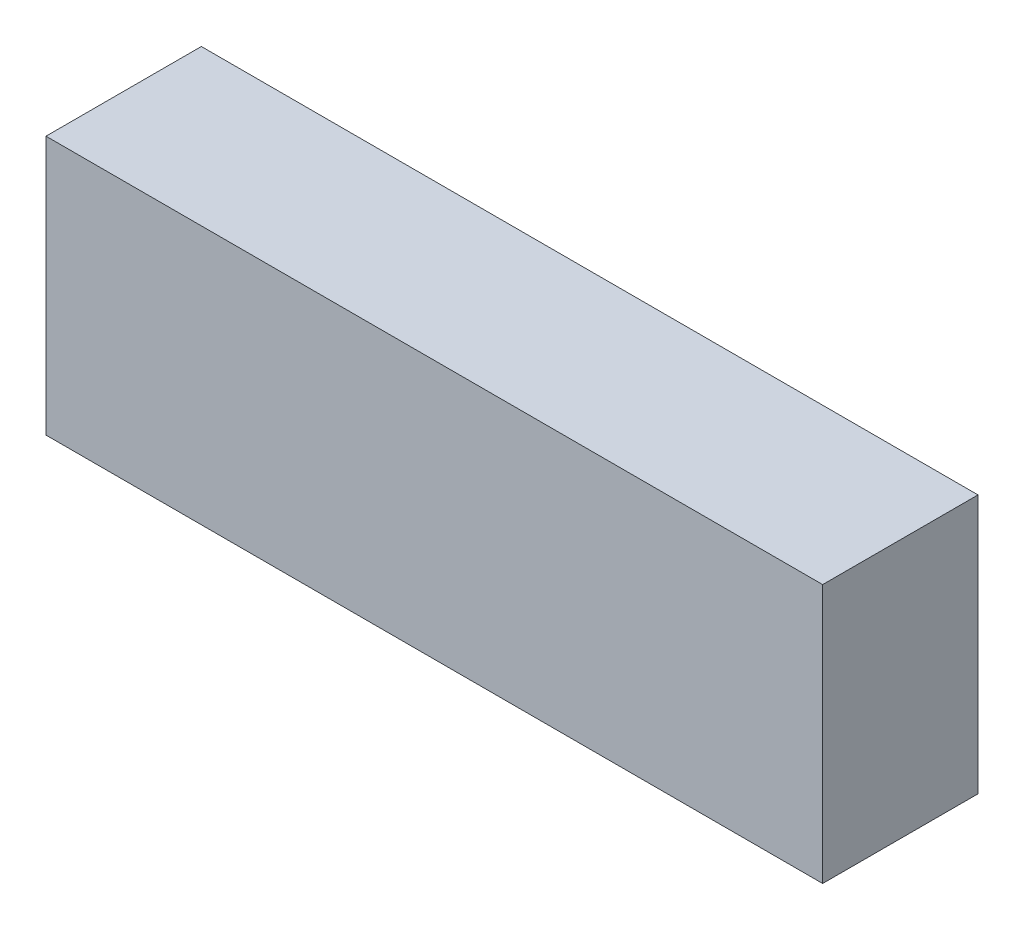
ISO-10303-21;
HEADER;
FILE_DESCRIPTION(('STEP AP214'),'2;1');
FILE_NAME('part.step','',(''),(''),'','','');
FILE_SCHEMA(('AUTOMOTIVE_DESIGN { 1 0 10303 214 1 1 1 1 }'));
ENDSEC;
DATA;
#1=APPLICATION_CONTEXT('core data for automotive mechanical design processes');
#2=APPLICATION_PROTOCOL_DEFINITION('international standard','automotive_design',2000,#1);
#3=PRODUCT_CONTEXT('',#1,'mechanical');
#4=PRODUCT('Part','Part','',(#3));
#5=PRODUCT_RELATED_PRODUCT_CATEGORY('part','',(#4));
#6=PRODUCT_DEFINITION_FORMATION('','',#4);
#7=PRODUCT_DEFINITION_CONTEXT('part definition',#1,'design');
#8=PRODUCT_DEFINITION('design','',#6,#7);
#9=PRODUCT_DEFINITION_SHAPE('','',#8);
#10=(LENGTH_UNIT() NAMED_UNIT(*) SI_UNIT(.MILLI.,.METRE.));
#11=(NAMED_UNIT(*) PLANE_ANGLE_UNIT() SI_UNIT($,.RADIAN.));
#12=(NAMED_UNIT(*) SI_UNIT($,.STERADIAN.) SOLID_ANGLE_UNIT());
#13=UNCERTAINTY_MEASURE_WITH_UNIT(LENGTH_MEASURE(1.E-05),#10,'distance_accuracy_value','');
#14=(GEOMETRIC_REPRESENTATION_CONTEXT(3) GLOBAL_UNCERTAINTY_ASSIGNED_CONTEXT((#13)) GLOBAL_UNIT_ASSIGNED_CONTEXT((#10,
#11,#12)) REPRESENTATION_CONTEXT('',''));
#15=CARTESIAN_POINT('',(0.,0.,0.));
#16=DIRECTION('',(0.,0.,1.));
#17=DIRECTION('',(1.,0.,0.));
#18=AXIS2_PLACEMENT_3D('',#15,#16,#17);
#19=CARTESIAN_POINT('',(-75.,50.,-28.2352941176471));
#20=DIRECTION('',(1.,0.,0.));
#21=DIRECTION('',(0.,0.,-1.));
#22=AXIS2_PLACEMENT_3D('',#19,#20,#21);
#23=PLANE('',#22);
#24=DIRECTION('',(0.,0.,1.));
#25=VECTOR('',#24,1.);
#26=CARTESIAN_POINT('',(-75.,0.,-28.2352941176471));
#27=LINE('',#26,#25);
#28=CARTESIAN_POINT('',(-75.,0.,-28.2352941176471));
#29=VERTEX_POINT('',#28);
#30=CARTESIAN_POINT('',(-75.,0.,1.76470588235295));
#31=VERTEX_POINT('',#30);
#32=EDGE_CURVE('E98',#29,#31,#27,.T.);
#33=ORIENTED_EDGE('',*,*,#32,.T.);
#34=DIRECTION('',(0.,-1.,0.));
#35=VECTOR('',#34,1.);
#36=CARTESIAN_POINT('',(-75.,50.,1.76470588235295));
#37=LINE('',#36,#35);
#38=CARTESIAN_POINT('',(-75.,50.,1.76470588235295));
#39=VERTEX_POINT('',#38);
#40=EDGE_CURVE('E11',#39,#31,#37,.T.);
#41=ORIENTED_EDGE('',*,*,#40,.F.);
#42=DIRECTION('',(0.,0.,1.));
#43=VECTOR('',#42,1.);
#44=CARTESIAN_POINT('',(-75.,50.,-28.2352941176471));
#45=LINE('',#44,#43);
#46=CARTESIAN_POINT('',(-75.,50.,-28.2352941176471));
#47=VERTEX_POINT('',#46);
#48=EDGE_CURVE('E86',#47,#39,#45,.T.);
#49=ORIENTED_EDGE('',*,*,#48,.F.);
#50=DIRECTION('',(0.,-1.,0.));
#51=VECTOR('',#50,1.);
#52=CARTESIAN_POINT('',(-75.,50.,-28.2352941176471));
#53=LINE('',#52,#51);
#54=EDGE_CURVE('E94',#47,#29,#53,.T.);
#55=ORIENTED_EDGE('',*,*,#54,.T.);
#56=EDGE_LOOP('',(#33,#41,#49,#55));
#57=FACE_BOUND('',#56,.T.);
#58=ADVANCED_FACE('F35',(#57),#23,.F.);
#59=CARTESIAN_POINT('',(-75.,50.,1.76470588235295));
#60=DIRECTION('',(0.,0.,-1.));
#61=DIRECTION('',(-1.,0.,0.));
#62=AXIS2_PLACEMENT_3D('',#59,#60,#61);
#63=PLANE('',#62);
#64=DIRECTION('',(1.,0.,0.));
#65=VECTOR('',#64,1.);
#66=CARTESIAN_POINT('',(-75.,0.,1.76470588235295));
#67=LINE('',#66,#65);
#68=CARTESIAN_POINT('',(75.,0.,1.76470588235295));
#69=VERTEX_POINT('',#68);
#70=EDGE_CURVE('E90',#31,#69,#67,.T.);
#71=ORIENTED_EDGE('',*,*,#70,.T.);
#72=DIRECTION('',(0.,-1.,0.));
#73=VECTOR('',#72,1.);
#74=CARTESIAN_POINT('',(75.,50.,1.76470588235295));
#75=LINE('',#74,#73);
#76=CARTESIAN_POINT('',(75.,50.,1.76470588235295));
#77=VERTEX_POINT('',#76);
#78=EDGE_CURVE('E43',#77,#69,#75,.T.);
#79=ORIENTED_EDGE('',*,*,#78,.F.);
#80=DIRECTION('',(1.,0.,0.));
#81=VECTOR('',#80,1.);
#82=CARTESIAN_POINT('',(-75.,50.,1.76470588235295));
#83=LINE('',#82,#81);
#84=EDGE_CURVE('E81',#39,#77,#83,.T.);
#85=ORIENTED_EDGE('',*,*,#84,.F.);
#86=ORIENTED_EDGE('',*,*,#40,.T.);
#87=EDGE_LOOP('',(#71,#79,#85,#86));
#88=FACE_BOUND('',#87,.T.);
#89=ADVANCED_FACE('F89',(#88),#63,.F.);
#90=CARTESIAN_POINT('',(75.,50.,-28.2352941176471));
#91=DIRECTION('',(-1.,0.,0.));
#92=DIRECTION('',(0.,0.,1.));
#93=AXIS2_PLACEMENT_3D('',#90,#91,#92);
#94=PLANE('',#93);
#95=DIRECTION('',(0.,0.,-1.));
#96=VECTOR('',#95,1.);
#97=CARTESIAN_POINT('',(75.,0.,-28.2352941176471));
#98=LINE('',#97,#96);
#99=CARTESIAN_POINT('',(75.,0.,-28.2352941176471));
#100=VERTEX_POINT('',#99);
#101=EDGE_CURVE('E68',#69,#100,#98,.T.);
#102=ORIENTED_EDGE('',*,*,#101,.T.);
#103=DIRECTION('',(0.,-1.,0.));
#104=VECTOR('',#103,1.);
#105=CARTESIAN_POINT('',(75.,50.,-28.2352941176471));
#106=LINE('',#105,#104);
#107=CARTESIAN_POINT('',(75.,50.,-28.2352941176471));
#108=VERTEX_POINT('',#107);
#109=EDGE_CURVE('E91',#108,#100,#106,.T.);
#110=ORIENTED_EDGE('',*,*,#109,.F.);
#111=DIRECTION('',(0.,0.,-1.));
#112=VECTOR('',#111,1.);
#113=CARTESIAN_POINT('',(75.,50.,-28.2352941176471));
#114=LINE('',#113,#112);
#115=EDGE_CURVE('E84',#77,#108,#114,.T.);
#116=ORIENTED_EDGE('',*,*,#115,.F.);
#117=ORIENTED_EDGE('',*,*,#78,.T.);
#118=EDGE_LOOP('',(#102,#110,#116,#117));
#119=FACE_BOUND('',#118,.T.);
#120=ADVANCED_FACE('F92',(#119),#94,.F.);
#121=CARTESIAN_POINT('',(-75.,50.,-28.2352941176471));
#122=DIRECTION('',(0.,0.,1.));
#123=DIRECTION('',(1.,0.,0.));
#124=AXIS2_PLACEMENT_3D('',#121,#122,#123);
#125=PLANE('',#124);
#126=DIRECTION('',(-1.,0.,0.));
#127=VECTOR('',#126,1.);
#128=CARTESIAN_POINT('',(-75.,0.,-28.2352941176471));
#129=LINE('',#128,#127);
#130=EDGE_CURVE('E74',#100,#29,#129,.T.);
#131=ORIENTED_EDGE('',*,*,#130,.T.);
#132=ORIENTED_EDGE('',*,*,#54,.F.);
#133=DIRECTION('',(-1.,0.,0.));
#134=VECTOR('',#133,1.);
#135=CARTESIAN_POINT('',(-75.,50.,-28.2352941176471));
#136=LINE('',#135,#134);
#137=EDGE_CURVE('E51',#108,#47,#136,.T.);
#138=ORIENTED_EDGE('',*,*,#137,.F.);
#139=ORIENTED_EDGE('',*,*,#109,.T.);
#140=EDGE_LOOP('',(#131,#132,#138,#139));
#141=FACE_BOUND('',#140,.T.);
#142=ADVANCED_FACE('F105',(#141),#125,.F.);
#143=CARTESIAN_POINT('',(0.,50.,0.));
#144=DIRECTION('',(0.,1.,0.));
#145=DIRECTION('',(0.,0.,1.));
#146=AXIS2_PLACEMENT_3D('',#143,#144,#145);
#147=PLANE('',#146);
#148=ORIENTED_EDGE('',*,*,#48,.T.);
#149=ORIENTED_EDGE('',*,*,#84,.T.);
#150=ORIENTED_EDGE('',*,*,#115,.T.);
#151=ORIENTED_EDGE('',*,*,#137,.T.);
#152=EDGE_LOOP('',(#148,#149,#150,#151));
#153=FACE_BOUND('',#152,.T.);
#154=ADVANCED_FACE('F82',(#153),#147,.T.);
#155=CARTESIAN_POINT('',(0.,0.,0.));
#156=DIRECTION('',(0.,1.,0.));
#157=DIRECTION('',(0.,0.,1.));
#158=AXIS2_PLACEMENT_3D('',#155,#156,#157);
#159=PLANE('',#158);
#160=ORIENTED_EDGE('',*,*,#32,.F.);
#161=ORIENTED_EDGE('',*,*,#130,.F.);
#162=ORIENTED_EDGE('',*,*,#101,.F.);
#163=ORIENTED_EDGE('',*,*,#70,.F.);
#164=EDGE_LOOP('',(#160,#161,#162,#163));
#165=FACE_BOUND('',#164,.T.);
#166=ADVANCED_FACE('F108',(#165),#159,.F.);
#167=CLOSED_SHELL('',(#58,#89,#120,#142,#154,#166));
#168=MANIFOLD_SOLID_BREP('B2',#167);
#169=ADVANCED_BREP_SHAPE_REPRESENTATION('',(#18,#168),#14);
#170=SHAPE_DEFINITION_REPRESENTATION(#9,#169);
ENDSEC;
END-ISO-10303-21;
